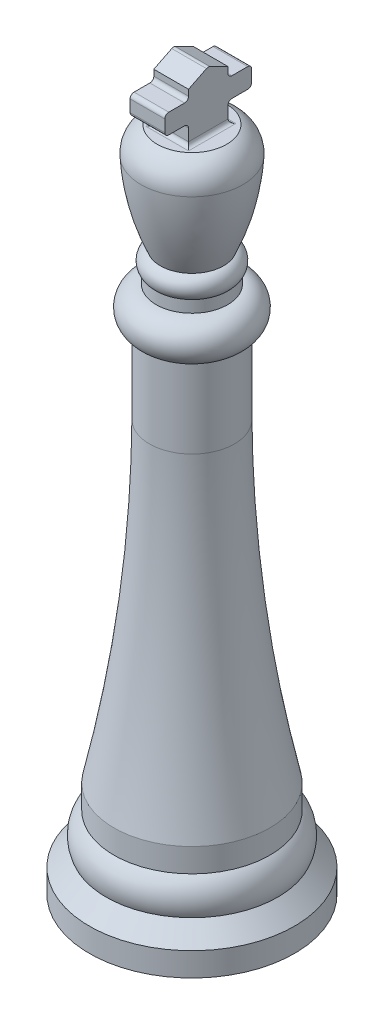
ISO-10303-21;
HEADER;
FILE_DESCRIPTION(('STEP AP214'),'2;1');
FILE_NAME('part.step','',(''),(''),'','','');
FILE_SCHEMA(('AUTOMOTIVE_DESIGN { 1 0 10303 214 1 1 1 1 }'));
ENDSEC;
DATA;
#1=APPLICATION_CONTEXT('core data for automotive mechanical design processes');
#2=APPLICATION_PROTOCOL_DEFINITION('international standard','automotive_design',2000,#1);
#3=PRODUCT_CONTEXT('',#1,'mechanical');
#4=PRODUCT('Part','Part','',(#3));
#5=PRODUCT_RELATED_PRODUCT_CATEGORY('part','',(#4));
#6=PRODUCT_DEFINITION_FORMATION('','',#4);
#7=PRODUCT_DEFINITION_CONTEXT('part definition',#1,'design');
#8=PRODUCT_DEFINITION('design','',#6,#7);
#9=PRODUCT_DEFINITION_SHAPE('','',#8);
#10=(LENGTH_UNIT() NAMED_UNIT(*) SI_UNIT(.MILLI.,.METRE.));
#11=(NAMED_UNIT(*) PLANE_ANGLE_UNIT() SI_UNIT($,.RADIAN.));
#12=(NAMED_UNIT(*) SI_UNIT($,.STERADIAN.) SOLID_ANGLE_UNIT());
#13=UNCERTAINTY_MEASURE_WITH_UNIT(LENGTH_MEASURE(1.E-05),#10,'distance_accuracy_value','');
#14=(GEOMETRIC_REPRESENTATION_CONTEXT(3) GLOBAL_UNCERTAINTY_ASSIGNED_CONTEXT((#13)) GLOBAL_UNIT_ASSIGNED_CONTEXT((#10,
#11,#12)) REPRESENTATION_CONTEXT('',''));
#15=CARTESIAN_POINT('',(0.,0.,0.));
#16=DIRECTION('',(0.,0.,1.));
#17=DIRECTION('',(1.,0.,0.));
#18=AXIS2_PLACEMENT_3D('',#15,#16,#17);
#19=CARTESIAN_POINT('',(2.23427851588815,42.926,0.));
#20=DIRECTION('',(0.,1.,0.));
#21=DIRECTION('',(0.,0.,1.));
#22=AXIS2_PLACEMENT_3D('',#19,#20,#21);
#23=PLANE('',#22);
#24=DIRECTION('',(0.,0.,1.));
#25=VECTOR('',#24,1.);
#26=CARTESIAN_POINT('',(-1.37113925794407,42.926,0.));
#27=LINE('',#26,#25);
#28=CARTESIAN_POINT('',(-1.37113925794406,42.926,1.5921332895163));
#29=VERTEX_POINT('',#28);
#30=CARTESIAN_POINT('',(-1.37113925794408,42.926,-1.4558667104837));
#31=VERTEX_POINT('',#30);
#32=EDGE_CURVE('E489',#29,#31,#27,.F.);
#33=ORIENTED_EDGE('',*,*,#32,.T.);
#34=DIRECTION('',(1.,0.,0.));
#35=VECTOR('',#34,1.);
#36=CARTESIAN_POINT('',(1.11713925794407,42.926,-1.45586671048372));
#37=LINE('',#36,#35);
#38=CARTESIAN_POINT('',(1.37113925794407,42.926,-1.45586671048372));
#39=VERTEX_POINT('',#38);
#40=EDGE_CURVE('E493',#31,#39,#37,.T.);
#41=ORIENTED_EDGE('',*,*,#40,.T.);
#42=DIRECTION('',(0.,0.,1.));
#43=VECTOR('',#42,1.);
#44=CARTESIAN_POINT('',(1.37113925794409,42.926,1.33813328951628));
#45=LINE('',#44,#43);
#46=CARTESIAN_POINT('',(1.3711392579441,42.926,1.59213328951628));
#47=VERTEX_POINT('',#46);
#48=EDGE_CURVE('E491',#39,#47,#45,.T.);
#49=ORIENTED_EDGE('',*,*,#48,.T.);
#50=DIRECTION('',(1.,0.,0.));
#51=VECTOR('',#50,1.);
#52=CARTESIAN_POINT('',(2.23427851588816,42.926,1.59213328951628));
#53=LINE('',#52,#51);
#54=EDGE_CURVE('E487',#47,#29,#53,.F.);
#55=ORIENTED_EDGE('',*,*,#54,.T.);
#56=EDGE_LOOP('',(#33,#41,#49,#55));
#57=FACE_BOUND('',#56,.T.);
#58=CARTESIAN_POINT('',(0.,42.926,0.));
#59=DIRECTION('',(0.,-1.,0.));
#60=DIRECTION('',(0.,0.,-1.));
#61=AXIS2_PLACEMENT_3D('',#58,#59,#60);
#62=CIRCLE('',#61,2.23427851588815);
#63=CARTESIAN_POINT('',(0.,42.926,-2.23427851588815));
#64=VERTEX_POINT('',#63);
#65=EDGE_CURVE('E281',#64,#64,#62,.T.);
#66=ORIENTED_EDGE('',*,*,#65,.F.);
#67=EDGE_LOOP('',(#66));
#68=FACE_BOUND('',#67,.T.);
#69=ADVANCED_FACE('F41',(#57,#68),#23,.T.);
#70=CARTESIAN_POINT('',(0.,0.,0.));
#71=DIRECTION('',(0.,-1.,0.));
#72=DIRECTION('',(0.,0.,-1.));
#73=AXIS2_PLACEMENT_3D('',#70,#71,#72);
#74=PLANE('',#73);
#75=CARTESIAN_POINT('',(0.,0.,0.));
#76=DIRECTION('',(0.,-1.,0.));
#77=DIRECTION('',(0.,0.,-1.));
#78=AXIS2_PLACEMENT_3D('',#75,#76,#77);
#79=CIRCLE('',#78,6.604);
#80=CARTESIAN_POINT('',(0.,0.,-6.604));
#81=VERTEX_POINT('',#80);
#82=EDGE_CURVE('E433',#81,#81,#79,.T.);
#83=ORIENTED_EDGE('',*,*,#82,.T.);
#84=EDGE_LOOP('',(#83));
#85=FACE_BOUND('',#84,.T.);
#86=ADVANCED_FACE('F353',(#85),#74,.T.);
#87=CARTESIAN_POINT('',(0.,0.,0.));
#88=DIRECTION('',(0.,-1.,0.));
#89=DIRECTION('',(0.,0.,-1.));
#90=AXIS2_PLACEMENT_3D('',#87,#88,#89);
#91=CYLINDRICAL_SURFACE('',#90,6.604);
#92=CARTESIAN_POINT('',(0.,1.524,0.));
#93=DIRECTION('',(0.,-1.,0.));
#94=DIRECTION('',(0.,0.,-1.));
#95=AXIS2_PLACEMENT_3D('',#92,#93,#94);
#96=CIRCLE('',#95,6.604);
#97=CARTESIAN_POINT('',(0.,1.524,-6.604));
#98=VERTEX_POINT('',#97);
#99=EDGE_CURVE('E430',#98,#98,#96,.T.);
#100=ORIENTED_EDGE('',*,*,#99,.T.);
#101=EDGE_LOOP('',(#100));
#102=FACE_BOUND('',#101,.T.);
#103=ORIENTED_EDGE('',*,*,#82,.F.);
#104=EDGE_LOOP('',(#103));
#105=FACE_BOUND('',#104,.T.);
#106=ADVANCED_FACE('F349',(#102,#105),#91,.T.);
#107=CARTESIAN_POINT('',(0.,1.524,0.));
#108=DIRECTION('',(0.,-1.,0.));
#109=DIRECTION('',(0.,0.,-1.));
#110=AXIS2_PLACEMENT_3D('',#107,#108,#109);
#111=CONICAL_SURFACE('',#110,6.604,0.785398163397448);
#112=CARTESIAN_POINT('',(0.,2.6016307345283,0.));
#113=DIRECTION('',(0.,-1.,0.));
#114=DIRECTION('',(0.,0.,-1.));
#115=AXIS2_PLACEMENT_3D('',#112,#113,#114);
#116=CIRCLE('',#115,5.5263692654717);
#117=CARTESIAN_POINT('',(0.,2.6016307345283,-5.5263692654717));
#118=VERTEX_POINT('',#117);
#119=EDGE_CURVE('E427',#118,#118,#116,.T.);
#120=ORIENTED_EDGE('',*,*,#119,.T.);
#121=EDGE_LOOP('',(#120));
#122=FACE_BOUND('',#121,.T.);
#123=ORIENTED_EDGE('',*,*,#99,.F.);
#124=EDGE_LOOP('',(#123));
#125=FACE_BOUND('',#124,.T.);
#126=ADVANCED_FACE('F345',(#122,#125),#111,.T.);
#127=CARTESIAN_POINT('',(0.,3.31038074482416,0.));
#128=DIRECTION('',(0.,-1.,0.));
#129=DIRECTION('',(0.,0.,-1.));
#130=AXIS2_PLACEMENT_3D('',#127,#128,#129);
#131=TOROIDAL_SURFACE('',#130,3.89573827628205,1.778);
#132=CARTESIAN_POINT('',(0.,4.68739876216002,0.));
#133=DIRECTION('',(0.,-1.,0.));
#134=DIRECTION('',(0.,0.,-1.));
#135=AXIS2_PLACEMENT_3D('',#132,#133,#134);
#136=CIRCLE('',#135,5.02050731032078);
#137=CARTESIAN_POINT('',(0.,4.68739876216002,-5.02050731032078));
#138=VERTEX_POINT('',#137);
#139=EDGE_CURVE('E424',#138,#138,#136,.T.);
#140=ORIENTED_EDGE('',*,*,#139,.T.);
#141=EDGE_LOOP('',(#140));
#142=FACE_BOUND('',#141,.T.);
#143=ORIENTED_EDGE('',*,*,#119,.F.);
#144=EDGE_LOOP('',(#143));
#145=FACE_BOUND('',#144,.T.);
#146=ADVANCED_FACE('F341',(#142,#145),#131,.T.);
#147=CARTESIAN_POINT('',(0.,0.,0.));
#148=DIRECTION('',(0.,-1.,0.));
#149=DIRECTION('',(0.,0.,-1.));
#150=AXIS2_PLACEMENT_3D('',#147,#148,#149);
#151=CYLINDRICAL_SURFACE('',#150,5.02050731032078);
#152=CARTESIAN_POINT('',(0.,6.21139876216002,0.));
#153=DIRECTION('',(0.,-1.,0.));
#154=DIRECTION('',(0.,0.,-1.));
#155=AXIS2_PLACEMENT_3D('',#152,#153,#154);
#156=CIRCLE('',#155,5.02050731032079);
#157=CARTESIAN_POINT('',(0.,6.21139876216002,-5.02050731032079));
#158=VERTEX_POINT('',#157);
#159=EDGE_CURVE('E416',#158,#158,#156,.T.);
#160=ORIENTED_EDGE('',*,*,#159,.T.);
#161=EDGE_LOOP('',(#160));
#162=FACE_BOUND('',#161,.T.);
#163=ORIENTED_EDGE('',*,*,#139,.F.);
#164=EDGE_LOOP('',(#163));
#165=FACE_BOUND('',#164,.T.);
#166=ADVANCED_FACE('F336',(#162,#165),#151,.T.);
#167=CARTESIAN_POINT('',(5.02050731032079,6.21139876216002,0.));
#168=CARTESIAN_POINT('',(2.79663497583493,16.1919932818318,0.));
#169=CARTESIAN_POINT('',(2.73354395721805,26.4720122158508,0.));
#170=B_SPLINE_CURVE_WITH_KNOTS('',2,(#167,#168,#169),.UNSPECIFIED.,.F.,.F.,(3,3),(0.,1.),.UNSPECIFIED.);
#171=CARTESIAN_POINT('',(0.,0.,0.));
#172=DIRECTION('',(0.,-1.,0.));
#173=AXIS1_PLACEMENT('',#171,#172);
#174=SURFACE_OF_REVOLUTION('',#170,#173);
#175=CARTESIAN_POINT('',(0.,26.4720122158508,0.));
#176=DIRECTION('',(0.,-1.,0.));
#177=DIRECTION('',(0.,0.,-1.));
#178=AXIS2_PLACEMENT_3D('',#175,#176,#177);
#179=CIRCLE('',#178,2.73354395721805);
#180=CARTESIAN_POINT('',(0.,26.4720122158508,-2.73354395721805));
#181=VERTEX_POINT('',#180);
#182=EDGE_CURVE('E413',#181,#181,#179,.T.);
#183=ORIENTED_EDGE('',*,*,#182,.T.);
#184=EDGE_LOOP('',(#183));
#185=FACE_BOUND('',#184,.T.);
#186=ORIENTED_EDGE('',*,*,#159,.F.);
#187=EDGE_LOOP('',(#186));
#188=FACE_BOUND('',#187,.T.);
#189=ADVANCED_FACE('F331',(#185,#188),#174,.F.);
#190=CARTESIAN_POINT('',(0.,0.,0.));
#191=DIRECTION('',(0.,-1.,0.));
#192=DIRECTION('',(0.,0.,-1.));
#193=AXIS2_PLACEMENT_3D('',#190,#191,#192);
#194=CYLINDRICAL_SURFACE('',#193,2.73354395721805);
#195=CARTESIAN_POINT('',(0.,31.5520122158508,0.));
#196=DIRECTION('',(0.,-1.,0.));
#197=DIRECTION('',(0.,0.,-1.));
#198=AXIS2_PLACEMENT_3D('',#195,#196,#197);
#199=CIRCLE('',#198,2.73354395721805);
#200=CARTESIAN_POINT('',(0.,31.5520122158508,-2.73354395721805));
#201=VERTEX_POINT('',#200);
#202=EDGE_CURVE('E412',#201,#201,#199,.T.);
#203=ORIENTED_EDGE('',*,*,#202,.T.);
#204=EDGE_LOOP('',(#203));
#205=FACE_BOUND('',#204,.T.);
#206=ORIENTED_EDGE('',*,*,#182,.F.);
#207=EDGE_LOOP('',(#206));
#208=FACE_BOUND('',#207,.T.);
#209=ADVANCED_FACE('F335',(#205,#208),#194,.T.);
#210=CARTESIAN_POINT('',(0.,32.7458638157194,0.));
#211=DIRECTION('',(0.,-1.,0.));
#212=DIRECTION('',(0.,0.,-1.));
#213=AXIS2_PLACEMENT_3D('',#210,#211,#212);
#214=TOROIDAL_SURFACE('',#213,2.3003946094276,1.27);
#215=CARTESIAN_POINT('',(0.,34.0158638157194,0.));
#216=DIRECTION('',(0.,-1.,0.));
#217=DIRECTION('',(0.,0.,-1.));
#218=AXIS2_PLACEMENT_3D('',#215,#216,#217);
#219=CIRCLE('',#218,2.3003946094276);
#220=CARTESIAN_POINT('',(0.,34.0158638157194,-2.3003946094276));
#221=VERTEX_POINT('',#220);
#222=EDGE_CURVE('E409',#221,#221,#219,.T.);
#223=ORIENTED_EDGE('',*,*,#222,.T.);
#224=EDGE_LOOP('',(#223));
#225=FACE_BOUND('',#224,.T.);
#226=ORIENTED_EDGE('',*,*,#202,.F.);
#227=EDGE_LOOP('',(#226));
#228=FACE_BOUND('',#227,.T.);
#229=ADVANCED_FACE('F398',(#225,#228),#214,.T.);
#230=CARTESIAN_POINT('',(0.,0.,0.));
#231=DIRECTION('',(0.,-1.,0.));
#232=DIRECTION('',(0.,0.,-1.));
#233=AXIS2_PLACEMENT_3D('',#230,#231,#232);
#234=CYLINDRICAL_SURFACE('',#233,2.3003946094276);
#235=CARTESIAN_POINT('',(0.,34.7778638157194,0.));
#236=DIRECTION('',(0.,-1.,0.));
#237=DIRECTION('',(0.,0.,-1.));
#238=AXIS2_PLACEMENT_3D('',#235,#236,#237);
#239=CIRCLE('',#238,2.3003946094276);
#240=CARTESIAN_POINT('',(0.,34.7778638157194,-2.3003946094276));
#241=VERTEX_POINT('',#240);
#242=EDGE_CURVE('E418',#241,#241,#239,.T.);
#243=ORIENTED_EDGE('',*,*,#242,.T.);
#244=EDGE_LOOP('',(#243));
#245=FACE_BOUND('',#244,.T.);
#246=ORIENTED_EDGE('',*,*,#222,.F.);
#247=EDGE_LOOP('',(#246));
#248=FACE_BOUND('',#247,.T.);
#249=ADVANCED_FACE('F395',(#245,#248),#234,.T.);
#250=CARTESIAN_POINT('',(0.,35.3364382945624,0.));
#251=DIRECTION('',(0.,-1.,0.));
#252=DIRECTION('',(0.,0.,-1.));
#253=AXIS2_PLACEMENT_3D('',#250,#251,#252);
#254=TOROIDAL_SURFACE('',#253,1.78209107713667,0.762);
#255=CARTESIAN_POINT('',(0.,36.0544116939489,0.));
#256=DIRECTION('',(0.,-1.,0.));
#257=DIRECTION('',(0.,0.,-1.));
#258=AXIS2_PLACEMENT_3D('',#255,#256,#257);
#259=CIRCLE('',#258,2.03735211563147);
#260=CARTESIAN_POINT('',(0.,36.0544116939489,-2.03735211563147));
#261=VERTEX_POINT('',#260);
#262=EDGE_CURVE('E909',#261,#261,#259,.T.);
#263=ORIENTED_EDGE('',*,*,#262,.T.);
#264=EDGE_LOOP('',(#263));
#265=FACE_BOUND('',#264,.T.);
#266=ORIENTED_EDGE('',*,*,#242,.F.);
#267=EDGE_LOOP('',(#266));
#268=FACE_BOUND('',#267,.T.);
#269=ADVANCED_FACE('F391',(#265,#268),#254,.T.);
#270=CARTESIAN_POINT('',(2.03735211563147,36.0544116939489,0.));
#271=CARTESIAN_POINT('',(2.75458880196994,37.6906108210151,0.));
#272=CARTESIAN_POINT('',(3.171523279303,39.4171242700639,0.));
#273=CARTESIAN_POINT('',(3.27973491167088,41.1965121927396,0.));
#274=B_SPLINE_CURVE_WITH_KNOTS('',3,(#270,#271,#272,#273),.UNSPECIFIED.,.F.,.F.,(4,4),(0.,
0.825528863209232),.UNSPECIFIED.);
#275=CARTESIAN_POINT('',(0.,0.,0.));
#276=DIRECTION('',(0.,-1.,0.));
#277=AXIS1_PLACEMENT('',#275,#276);
#278=SURFACE_OF_REVOLUTION('',#274,#277);
#279=CARTESIAN_POINT('',(0.,41.1965121927396,0.));
#280=DIRECTION('',(0.,-1.,0.));
#281=DIRECTION('',(0.,0.,-1.));
#282=AXIS2_PLACEMENT_3D('',#279,#280,#281);
#283=CIRCLE('',#282,3.27973491167088);
#284=CARTESIAN_POINT('',(0.,41.1965121927396,-3.27973491167088));
#285=VERTEX_POINT('',#284);
#286=EDGE_CURVE('E912',#285,#285,#283,.T.);
#287=ORIENTED_EDGE('',*,*,#286,.T.);
#288=EDGE_LOOP('',(#287));
#289=FACE_BOUND('',#288,.T.);
#290=ORIENTED_EDGE('',*,*,#262,.F.);
#291=EDGE_LOOP('',(#290));
#292=FACE_BOUND('',#291,.T.);
#293=ADVANCED_FACE('F387',(#289,#292),#278,.F.);
#294=CARTESIAN_POINT('',(0.,41.3044400273974,0.));
#295=DIRECTION('',(0.,-1.,0.));
#296=DIRECTION('',(0.,0.,-1.));
#297=AXIS2_PLACEMENT_3D('',#294,#295,#296);
#298=DEGENERATE_TOROIDAL_SURFACE('',#297,1.50501364270888,1.778,.T.);
#299=ORIENTED_EDGE('',*,*,#65,.T.);
#300=EDGE_LOOP('',(#299));
#301=FACE_BOUND('',#300,.T.);
#302=ORIENTED_EDGE('',*,*,#286,.F.);
#303=EDGE_LOOP('',(#302));
#304=FACE_BOUND('',#303,.T.);
#305=ADVANCED_FACE('F384',(#301,#304),#298,.T.);
#306=CARTESIAN_POINT('',(1.11713925794408,46.736,0.));
#307=DIRECTION('',(1.,0.,0.));
#308=DIRECTION('',(0.,0.,-1.));
#309=AXIS2_PLACEMENT_3D('',#306,#307,#308);
#310=PLANE('',#309);
#311=DIRECTION('',(0.,1.,0.));
#312=VECTOR('',#311,1.);
#313=CARTESIAN_POINT('',(1.11713925794409,0.,1.33813328951628));
#314=LINE('',#313,#312);
#315=CARTESIAN_POINT('',(1.11713925794409,43.18,1.33813328951628));
#316=VERTEX_POINT('',#315);
#317=CARTESIAN_POINT('',(1.11713925794409,43.942,1.33813328951628));
#318=VERTEX_POINT('',#317);
#319=EDGE_CURVE('E253',#316,#318,#314,.T.);
#320=ORIENTED_EDGE('',*,*,#319,.F.);
#321=DIRECTION('',(0.,0.,1.));
#322=VECTOR('',#321,1.);
#323=CARTESIAN_POINT('',(1.11713925794408,43.18,-1.20186671048372));
#324=LINE('',#323,#322);
#325=CARTESIAN_POINT('',(1.11713925794408,43.18,-1.20186671048372));
#326=VERTEX_POINT('',#325);
#327=EDGE_CURVE('E499',#316,#326,#324,.F.);
#328=ORIENTED_EDGE('',*,*,#327,.T.);
#329=DIRECTION('',(0.,1.,0.));
#330=VECTOR('',#329,1.);
#331=CARTESIAN_POINT('',(1.11713925794408,0.,-1.20186671048372));
#332=LINE('',#331,#330);
#333=CARTESIAN_POINT('',(1.11713925794408,43.942,-1.20186671048372));
#334=VERTEX_POINT('',#333);
#335=EDGE_CURVE('E251',#326,#334,#332,.T.);
#336=ORIENTED_EDGE('',*,*,#335,.T.);
#337=CARTESIAN_POINT('',(1.11713925794407,43.942,-1.45586671048372));
#338=DIRECTION('',(1.,0.,0.));
#339=DIRECTION('',(0.,0.,-1.));
#340=AXIS2_PLACEMENT_3D('',#337,#338,#339);
#341=CIRCLE('',#340,0.253999999999999);
#342=CARTESIAN_POINT('',(1.11713925794407,44.196,-1.45586671048372));
#343=VERTEX_POINT('',#342);
#344=EDGE_CURVE('E248',#334,#343,#341,.F.);
#345=ORIENTED_EDGE('',*,*,#344,.T.);
#346=DIRECTION('',(0.,0.,-1.));
#347=VECTOR('',#346,1.);
#348=CARTESIAN_POINT('',(1.11713925794408,44.196,0.));
#349=LINE('',#348,#347);
#350=CARTESIAN_POINT('',(1.11713925794407,44.196,-2.47186671048371));
#351=VERTEX_POINT('',#350);
#352=EDGE_CURVE('E245',#343,#351,#349,.T.);
#353=ORIENTED_EDGE('',*,*,#352,.T.);
#354=CARTESIAN_POINT('',(1.11713925794407,44.45,-2.47186671048372));
#355=DIRECTION('',(1.,0.,0.));
#356=DIRECTION('',(0.,0.,-1.));
#357=AXIS2_PLACEMENT_3D('',#354,#355,#356);
#358=CIRCLE('',#357,0.253999999999999);
#359=CARTESIAN_POINT('',(1.11713925794407,44.45,-2.72586671048372));
#360=VERTEX_POINT('',#359);
#361=EDGE_CURVE('E242',#351,#360,#358,.T.);
#362=ORIENTED_EDGE('',*,*,#361,.T.);
#363=DIRECTION('',(0.,1.,0.));
#364=VECTOR('',#363,1.);
#365=CARTESIAN_POINT('',(1.11713925794407,0.,-2.72586671048372));
#366=LINE('',#365,#364);
#367=CARTESIAN_POINT('',(1.11713925794407,45.212,-2.72586671048372));
#368=VERTEX_POINT('',#367);
#369=EDGE_CURVE('E239',#360,#368,#366,.T.);
#370=ORIENTED_EDGE('',*,*,#369,.T.);
#371=CARTESIAN_POINT('',(1.11713925794407,45.212,-2.47186671048372));
#372=DIRECTION('',(1.,0.,0.));
#373=DIRECTION('',(0.,0.,-1.));
#374=AXIS2_PLACEMENT_3D('',#371,#372,#373);
#375=CIRCLE('',#374,0.253999999999999);
#376=CARTESIAN_POINT('',(1.11713925794407,45.466,-2.47186671048371));
#377=VERTEX_POINT('',#376);
#378=EDGE_CURVE('E236',#368,#377,#375,.T.);
#379=ORIENTED_EDGE('',*,*,#378,.T.);
#380=DIRECTION('',(0.,0.,1.));
#381=VECTOR('',#380,1.);
#382=CARTESIAN_POINT('',(1.11713925794408,45.466,0.));
#383=LINE('',#382,#381);
#384=CARTESIAN_POINT('',(1.11713925794407,45.466,-1.45586671048372));
#385=VERTEX_POINT('',#384);
#386=EDGE_CURVE('E233',#377,#385,#383,.T.);
#387=ORIENTED_EDGE('',*,*,#386,.T.);
#388=CARTESIAN_POINT('',(1.11713925794407,45.72,-1.45586671048372));
#389=DIRECTION('',(1.,0.,0.));
#390=DIRECTION('',(0.,0.,-1.));
#391=AXIS2_PLACEMENT_3D('',#388,#389,#390);
#392=CIRCLE('',#391,0.253999999999999);
#393=CARTESIAN_POINT('',(1.11713925794408,45.72,-1.20186671048372));
#394=VERTEX_POINT('',#393);
#395=EDGE_CURVE('E229',#385,#394,#392,.F.);
#396=ORIENTED_EDGE('',*,*,#395,.T.);
#397=DIRECTION('',(0.,1.,0.));
#398=VECTOR('',#397,1.);
#399=CARTESIAN_POINT('',(1.11713925794408,0.,-1.20186671048372));
#400=LINE('',#399,#398);
#401=CARTESIAN_POINT('',(1.11713925794408,46.1061898301753,-1.20186671048372));
#402=VERTEX_POINT('',#401);
#403=EDGE_CURVE('E227',#394,#402,#400,.T.);
#404=ORIENTED_EDGE('',*,*,#403,.T.);
#405=DIRECTION('',(0.,0.444282378740379,0.895886805316827));
#406=VECTOR('',#405,1.);
#407=CARTESIAN_POINT('',(1.11713925794396,37.4838101470672,-18.5887282160634));
#408=LINE('',#407,#406);
#409=CARTESIAN_POINT('',(1.11713925794408,46.6800372879191,-0.0447144346837729));
#410=VERTEX_POINT('',#409);
#411=EDGE_CURVE('E206',#402,#410,#408,.T.);
#412=ORIENTED_EDGE('',*,*,#411,.T.);
#413=CARTESIAN_POINT('',(1.11713925794408,46.4524820393686,0.0681332895162846));
#414=DIRECTION('',(1.,0.,0.));
#415=DIRECTION('',(0.,0.,-1.));
#416=AXIS2_PLACEMENT_3D('',#413,#414,#415);
#417=CIRCLE('',#416,0.254000000000002);
#418=CARTESIAN_POINT('',(1.11713925794409,46.6800372879191,0.180981013716344));
#419=VERTEX_POINT('',#418);
#420=EDGE_CURVE('E216',#410,#419,#417,.T.);
#421=ORIENTED_EDGE('',*,*,#420,.T.);
#422=DIRECTION('',(0.,0.444282378740379,-0.895886805316827));
#423=VECTOR('',#422,1.);
#424=CARTESIAN_POINT('',(1.11713925794421,37.5380478866944,18.6156254444141));
#425=LINE('',#424,#423);
#426=CARTESIAN_POINT('',(1.11713925794409,46.1061898301753,1.33813328951628));
#427=VERTEX_POINT('',#426);
#428=EDGE_CURVE('E213',#427,#419,#425,.T.);
#429=ORIENTED_EDGE('',*,*,#428,.F.);
#430=DIRECTION('',(0.,1.,0.));
#431=VECTOR('',#430,1.);
#432=CARTESIAN_POINT('',(1.11713925794409,0.,1.33813328951628));
#433=LINE('',#432,#431);
#434=CARTESIAN_POINT('',(1.11713925794409,45.72,1.33813328951628));
#435=VERTEX_POINT('',#434);
#436=EDGE_CURVE('E276',#435,#427,#433,.T.);
#437=ORIENTED_EDGE('',*,*,#436,.F.);
#438=CARTESIAN_POINT('',(1.1171392579441,45.72,1.59213328951628));
#439=DIRECTION('',(1.,0.,0.));
#440=DIRECTION('',(0.,0.,-1.));
#441=AXIS2_PLACEMENT_3D('',#438,#439,#440);
#442=CIRCLE('',#441,0.253999999999999);
#443=CARTESIAN_POINT('',(1.1171392579441,45.466,1.59213328951629));
#444=VERTEX_POINT('',#443);
#445=EDGE_CURVE('E273',#444,#435,#442,.T.);
#446=ORIENTED_EDGE('',*,*,#445,.F.);
#447=DIRECTION('',(0.,0.,-1.));
#448=VECTOR('',#447,1.);
#449=CARTESIAN_POINT('',(1.11713925794408,45.466,0.));
#450=LINE('',#449,#448);
#451=CARTESIAN_POINT('',(1.1171392579441,45.466,2.60813328951628));
#452=VERTEX_POINT('',#451);
#453=EDGE_CURVE('E270',#452,#444,#450,.T.);
#454=ORIENTED_EDGE('',*,*,#453,.F.);
#455=CARTESIAN_POINT('',(1.1171392579441,45.212,2.60813328951629));
#456=DIRECTION('',(1.,0.,0.));
#457=DIRECTION('',(0.,0.,-1.));
#458=AXIS2_PLACEMENT_3D('',#455,#456,#457);
#459=CIRCLE('',#458,0.253999999999999);
#460=CARTESIAN_POINT('',(1.1171392579441,45.212,2.86213328951629));
#461=VERTEX_POINT('',#460);
#462=EDGE_CURVE('E267',#461,#452,#459,.F.);
#463=ORIENTED_EDGE('',*,*,#462,.F.);
#464=DIRECTION('',(0.,1.,0.));
#465=VECTOR('',#464,1.);
#466=CARTESIAN_POINT('',(1.1171392579441,0.,2.86213328951629));
#467=LINE('',#466,#465);
#468=CARTESIAN_POINT('',(1.1171392579441,44.45,2.86213328951629));
#469=VERTEX_POINT('',#468);
#470=EDGE_CURVE('E264',#469,#461,#467,.T.);
#471=ORIENTED_EDGE('',*,*,#470,.F.);
#472=CARTESIAN_POINT('',(1.1171392579441,44.45,2.60813328951629));
#473=DIRECTION('',(1.,0.,0.));
#474=DIRECTION('',(0.,0.,-1.));
#475=AXIS2_PLACEMENT_3D('',#472,#473,#474);
#476=CIRCLE('',#475,0.253999999999999);
#477=CARTESIAN_POINT('',(1.1171392579441,44.196,2.60813328951628));
#478=VERTEX_POINT('',#477);
#479=EDGE_CURVE('E261',#478,#469,#476,.F.);
#480=ORIENTED_EDGE('',*,*,#479,.F.);
#481=DIRECTION('',(0.,0.,1.));
#482=VECTOR('',#481,1.);
#483=CARTESIAN_POINT('',(1.11713925794408,44.196,0.));
#484=LINE('',#483,#482);
#485=CARTESIAN_POINT('',(1.1171392579441,44.196,1.59213328951629));
#486=VERTEX_POINT('',#485);
#487=EDGE_CURVE('E258',#486,#478,#484,.T.);
#488=ORIENTED_EDGE('',*,*,#487,.F.);
#489=CARTESIAN_POINT('',(1.1171392579441,43.942,1.59213328951628));
#490=DIRECTION('',(1.,0.,0.));
#491=DIRECTION('',(0.,0.,-1.));
#492=AXIS2_PLACEMENT_3D('',#489,#490,#491);
#493=CIRCLE('',#492,0.253999999999999);
#494=EDGE_CURVE('E255',#318,#486,#493,.T.);
#495=ORIENTED_EDGE('',*,*,#494,.F.);
#496=EDGE_LOOP('',(#320,#328,#336,#345,#353,#362,#370,#379,#387,#396,#404,#412,#421,#429,#437,
#446,#454,#463,#471,#480,#488,#495));
#497=FACE_BOUND('',#496,.T.);
#498=ADVANCED_FACE('F224',(#497),#310,.T.);
#499=CARTESIAN_POINT('',(-1.11713925794407,46.736,0.));
#500=DIRECTION('',(1.,0.,0.));
#501=DIRECTION('',(0.,0.,-1.));
#502=AXIS2_PLACEMENT_3D('',#499,#500,#501);
#503=PLANE('',#502);
#504=DIRECTION('',(0.,1.,0.));
#505=VECTOR('',#504,1.);
#506=CARTESIAN_POINT('',(-1.11713925794408,46.736,-1.2018667104837));
#507=LINE('',#506,#505);
#508=CARTESIAN_POINT('',(-1.11713925794408,43.18,-1.2018667104837));
#509=VERTEX_POINT('',#508);
#510=CARTESIAN_POINT('',(-1.11713925794408,43.942,-1.2018667104837));
#511=VERTEX_POINT('',#510);
#512=EDGE_CURVE('E454',#509,#511,#507,.T.);
#513=ORIENTED_EDGE('',*,*,#512,.F.);
#514=DIRECTION('',(0.,0.,1.));
#515=VECTOR('',#514,1.);
#516=CARTESIAN_POINT('',(-1.11713925794407,43.18,0.));
#517=LINE('',#516,#515);
#518=CARTESIAN_POINT('',(-1.11713925794406,43.18,1.3381332895163));
#519=VERTEX_POINT('',#518);
#520=EDGE_CURVE('E50',#509,#519,#517,.T.);
#521=ORIENTED_EDGE('',*,*,#520,.T.);
#522=DIRECTION('',(0.,1.,0.));
#523=VECTOR('',#522,1.);
#524=CARTESIAN_POINT('',(-1.11713925794406,46.736,1.3381332895163));
#525=LINE('',#524,#523);
#526=CARTESIAN_POINT('',(-1.11713925794406,43.942,1.3381332895163));
#527=VERTEX_POINT('',#526);
#528=EDGE_CURVE('E485',#519,#527,#525,.T.);
#529=ORIENTED_EDGE('',*,*,#528,.T.);
#530=CARTESIAN_POINT('',(-1.11713925794406,43.942,1.5921332895163));
#531=DIRECTION('',(1.,0.,0.));
#532=DIRECTION('',(0.,0.,-1.));
#533=AXIS2_PLACEMENT_3D('',#530,#531,#532);
#534=CIRCLE('',#533,0.253999999999999);
#535=CARTESIAN_POINT('',(-1.11713925794406,44.196,1.5921332895163));
#536=VERTEX_POINT('',#535);
#537=EDGE_CURVE('E482',#527,#536,#534,.T.);
#538=ORIENTED_EDGE('',*,*,#537,.T.);
#539=DIRECTION('',(0.,0.,1.));
#540=VECTOR('',#539,1.);
#541=CARTESIAN_POINT('',(-1.11713925794407,44.196,0.));
#542=LINE('',#541,#540);
#543=CARTESIAN_POINT('',(-1.11713925794406,44.196,2.6081332895163));
#544=VERTEX_POINT('',#543);
#545=EDGE_CURVE('E479',#536,#544,#542,.T.);
#546=ORIENTED_EDGE('',*,*,#545,.T.);
#547=CARTESIAN_POINT('',(-1.11713925794405,44.45,2.6081332895163));
#548=DIRECTION('',(1.,0.,0.));
#549=DIRECTION('',(0.,0.,-1.));
#550=AXIS2_PLACEMENT_3D('',#547,#548,#549);
#551=CIRCLE('',#550,0.253999999999999);
#552=CARTESIAN_POINT('',(-1.11713925794405,44.45,2.8621332895163));
#553=VERTEX_POINT('',#552);
#554=EDGE_CURVE('E476',#544,#553,#551,.F.);
#555=ORIENTED_EDGE('',*,*,#554,.T.);
#556=DIRECTION('',(0.,1.,0.));
#557=VECTOR('',#556,1.);
#558=CARTESIAN_POINT('',(-1.11713925794405,46.736,2.8621332895163));
#559=LINE('',#558,#557);
#560=CARTESIAN_POINT('',(-1.11713925794405,45.212,2.8621332895163));
#561=VERTEX_POINT('',#560);
#562=EDGE_CURVE('E473',#553,#561,#559,.T.);
#563=ORIENTED_EDGE('',*,*,#562,.T.);
#564=CARTESIAN_POINT('',(-1.11713925794405,45.212,2.6081332895163));
#565=DIRECTION('',(1.,0.,0.));
#566=DIRECTION('',(0.,0.,-1.));
#567=AXIS2_PLACEMENT_3D('',#564,#565,#566);
#568=CIRCLE('',#567,0.253999999999999);
#569=CARTESIAN_POINT('',(-1.11713925794405,45.466,2.6081332895163));
#570=VERTEX_POINT('',#569);
#571=EDGE_CURVE('E470',#561,#570,#568,.F.);
#572=ORIENTED_EDGE('',*,*,#571,.T.);
#573=DIRECTION('',(0.,0.,-1.));
#574=VECTOR('',#573,1.);
#575=CARTESIAN_POINT('',(-1.11713925794407,45.466,0.));
#576=LINE('',#575,#574);
#577=CARTESIAN_POINT('',(-1.11713925794406,45.466,1.5921332895163));
#578=VERTEX_POINT('',#577);
#579=EDGE_CURVE('E467',#570,#578,#576,.T.);
#580=ORIENTED_EDGE('',*,*,#579,.T.);
#581=CARTESIAN_POINT('',(-1.11713925794406,45.72,1.5921332895163));
#582=DIRECTION('',(1.,0.,0.));
#583=DIRECTION('',(0.,0.,-1.));
#584=AXIS2_PLACEMENT_3D('',#581,#582,#583);
#585=CIRCLE('',#584,0.253999999999999);
#586=CARTESIAN_POINT('',(-1.11713925794406,45.72,1.3381332895163));
#587=VERTEX_POINT('',#586);
#588=EDGE_CURVE('E464',#578,#587,#585,.T.);
#589=ORIENTED_EDGE('',*,*,#588,.T.);
#590=DIRECTION('',(0.,1.,0.));
#591=VECTOR('',#590,1.);
#592=CARTESIAN_POINT('',(-1.11713925794406,46.736,1.3381332895163));
#593=LINE('',#592,#591);
#594=CARTESIAN_POINT('',(-1.11713925794406,46.1061898301753,1.3381332895163));
#595=VERTEX_POINT('',#594);
#596=EDGE_CURVE('E461',#587,#595,#593,.T.);
#597=ORIENTED_EDGE('',*,*,#596,.T.);
#598=DIRECTION('',(0.,0.444282378740379,-0.895886805316827));
#599=VECTOR('',#598,1.);
#600=CARTESIAN_POINT('',(-1.11713925794407,46.7631188698136,0.0134486141754039));
#601=LINE('',#600,#599);
#602=CARTESIAN_POINT('',(-1.11713925794407,46.6800372879191,0.18098101371636));
#603=VERTEX_POINT('',#602);
#604=EDGE_CURVE('E458',#595,#603,#601,.T.);
#605=ORIENTED_EDGE('',*,*,#604,.T.);
#606=CARTESIAN_POINT('',(-1.11713925794407,46.4524820393686,0.0681332895163002));
#607=DIRECTION('',(1.,0.,0.));
#608=DIRECTION('',(0.,0.,-1.));
#609=AXIS2_PLACEMENT_3D('',#606,#607,#608);
#610=CIRCLE('',#609,0.254000000000002);
#611=CARTESIAN_POINT('',(-1.11713925794408,46.6800372879191,-0.0447144346837573));
#612=VERTEX_POINT('',#611);
#613=EDGE_CURVE('E456',#612,#603,#610,.T.);
#614=ORIENTED_EDGE('',*,*,#613,.F.);
#615=DIRECTION('',(0.,0.444282378740379,0.895886805316827));
#616=VECTOR('',#615,1.);
#617=CARTESIAN_POINT('',(-1.11713925794407,46.7088811301864,0.0134486141753985));
#618=LINE('',#617,#616);
#619=CARTESIAN_POINT('',(-1.11713925794408,46.1061898301753,-1.20186671048372));
#620=VERTEX_POINT('',#619);
#621=EDGE_CURVE('E209',#620,#612,#618,.T.);
#622=ORIENTED_EDGE('',*,*,#621,.F.);
#623=DIRECTION('',(0.,1.,0.));
#624=VECTOR('',#623,1.);
#625=CARTESIAN_POINT('',(-1.11713925794408,46.736,-1.2018667104837));
#626=LINE('',#625,#624);
#627=CARTESIAN_POINT('',(-1.11713925794408,45.72,-1.2018667104837));
#628=VERTEX_POINT('',#627);
#629=EDGE_CURVE('E437',#628,#620,#626,.T.);
#630=ORIENTED_EDGE('',*,*,#629,.F.);
#631=CARTESIAN_POINT('',(-1.11713925794408,45.72,-1.4558667104837));
#632=DIRECTION('',(1.,0.,0.));
#633=DIRECTION('',(0.,0.,-1.));
#634=AXIS2_PLACEMENT_3D('',#631,#632,#633);
#635=CIRCLE('',#634,0.253999999999999);
#636=CARTESIAN_POINT('',(-1.11713925794408,45.466,-1.4558667104837));
#637=VERTEX_POINT('',#636);
#638=EDGE_CURVE('E440',#637,#628,#635,.F.);
#639=ORIENTED_EDGE('',*,*,#638,.F.);
#640=DIRECTION('',(0.,0.,1.));
#641=VECTOR('',#640,1.);
#642=CARTESIAN_POINT('',(-1.11713925794407,45.466,0.));
#643=LINE('',#642,#641);
#644=CARTESIAN_POINT('',(-1.11713925794408,45.466,-2.4718667104837));
#645=VERTEX_POINT('',#644);
#646=EDGE_CURVE('E442',#645,#637,#643,.T.);
#647=ORIENTED_EDGE('',*,*,#646,.F.);
#648=CARTESIAN_POINT('',(-1.11713925794409,45.212,-2.4718667104837));
#649=DIRECTION('',(1.,0.,0.));
#650=DIRECTION('',(0.,0.,-1.));
#651=AXIS2_PLACEMENT_3D('',#648,#649,#650);
#652=CIRCLE('',#651,0.253999999999999);
#653=CARTESIAN_POINT('',(-1.11713925794409,45.212,-2.7258667104837));
#654=VERTEX_POINT('',#653);
#655=EDGE_CURVE('E444',#654,#645,#652,.T.);
#656=ORIENTED_EDGE('',*,*,#655,.F.);
#657=DIRECTION('',(0.,1.,0.));
#658=VECTOR('',#657,1.);
#659=CARTESIAN_POINT('',(-1.11713925794409,46.736,-2.7258667104837));
#660=LINE('',#659,#658);
#661=CARTESIAN_POINT('',(-1.11713925794409,44.45,-2.7258667104837));
#662=VERTEX_POINT('',#661);
#663=EDGE_CURVE('E446',#662,#654,#660,.T.);
#664=ORIENTED_EDGE('',*,*,#663,.F.);
#665=CARTESIAN_POINT('',(-1.11713925794409,44.45,-2.4718667104837));
#666=DIRECTION('',(1.,0.,0.));
#667=DIRECTION('',(0.,0.,-1.));
#668=AXIS2_PLACEMENT_3D('',#665,#666,#667);
#669=CIRCLE('',#668,0.253999999999999);
#670=CARTESIAN_POINT('',(-1.11713925794409,44.196,-2.4718667104837));
#671=VERTEX_POINT('',#670);
#672=EDGE_CURVE('E448',#671,#662,#669,.T.);
#673=ORIENTED_EDGE('',*,*,#672,.F.);
#674=DIRECTION('',(0.,0.,-1.));
#675=VECTOR('',#674,1.);
#676=CARTESIAN_POINT('',(-1.11713925794407,44.196,0.));
#677=LINE('',#676,#675);
#678=CARTESIAN_POINT('',(-1.11713925794408,44.196,-1.4558667104837));
#679=VERTEX_POINT('',#678);
#680=EDGE_CURVE('E450',#679,#671,#677,.T.);
#681=ORIENTED_EDGE('',*,*,#680,.F.);
#682=CARTESIAN_POINT('',(-1.11713925794408,43.942,-1.4558667104837));
#683=DIRECTION('',(1.,0.,0.));
#684=DIRECTION('',(0.,0.,-1.));
#685=AXIS2_PLACEMENT_3D('',#682,#683,#684);
#686=CIRCLE('',#685,0.253999999999999);
#687=EDGE_CURVE('E452',#511,#679,#686,.F.);
#688=ORIENTED_EDGE('',*,*,#687,.F.);
#689=EDGE_LOOP('',(#513,#521,#529,#538,#546,#555,#563,#572,#580,#589,#597,#605,#614,#622,#630,
#639,#647,#656,#664,#673,#681,#688));
#690=FACE_BOUND('',#689,.T.);
#691=ADVANCED_FACE('F560',(#690),#503,.F.);
#692=CARTESIAN_POINT('',(-1.16886074205592,46.4524820393686,0.0681332895163005));
#693=DIRECTION('',(1.,0.,0.));
#694=DIRECTION('',(0.,0.,-1.));
#695=AXIS2_PLACEMENT_3D('',#692,#693,#694);
#696=CYLINDRICAL_SURFACE('',#695,0.254000000000002);
#697=ORIENTED_EDGE('',*,*,#613,.T.);
#698=DIRECTION('',(1.,0.,0.));
#699=VECTOR('',#698,1.);
#700=CARTESIAN_POINT('',(-1.16886074205591,46.6800372879191,0.18098101371636));
#701=LINE('',#700,#699);
#702=EDGE_CURVE('E219',#603,#419,#701,.T.);
#703=ORIENTED_EDGE('',*,*,#702,.T.);
#704=ORIENTED_EDGE('',*,*,#420,.F.);
#705=DIRECTION('',(1.,0.,0.));
#706=VECTOR('',#705,1.);
#707=CARTESIAN_POINT('',(-1.16886074205592,46.6800372879191,-0.044714434683757));
#708=LINE('',#707,#706);
#709=EDGE_CURVE('E202',#612,#410,#708,.T.);
#710=ORIENTED_EDGE('',*,*,#709,.F.);
#711=EDGE_LOOP('',(#697,#703,#704,#710));
#712=FACE_BOUND('',#711,.T.);
#713=ADVANCED_FACE('F217',(#712),#696,.T.);
#714=CARTESIAN_POINT('',(-1.16886074205579,37.5380478866944,18.6156254444142));
#715=DIRECTION('',(0.,-0.895886805316827,-0.444282378740379));
#716=DIRECTION('',(0.,0.444282378740379,-0.895886805316827));
#717=AXIS2_PLACEMENT_3D('',#714,#715,#716);
#718=PLANE('',#717);
#719=DIRECTION('',(1.,0.,0.));
#720=VECTOR('',#719,1.);
#721=CARTESIAN_POINT('',(-1.16886074205591,46.1061898301753,1.3381332895163));
#722=LINE('',#721,#720);
#723=EDGE_CURVE('E282',#595,#427,#722,.T.);
#724=ORIENTED_EDGE('',*,*,#723,.T.);
#725=ORIENTED_EDGE('',*,*,#428,.T.);
#726=ORIENTED_EDGE('',*,*,#702,.F.);
#727=ORIENTED_EDGE('',*,*,#604,.F.);
#728=EDGE_LOOP('',(#724,#725,#726,#727));
#729=FACE_BOUND('',#728,.T.);
#730=ADVANCED_FACE('F562',(#729),#718,.F.);
#731=CARTESIAN_POINT('',(-1.16886074205591,0.,1.3381332895163));
#732=DIRECTION('',(0.,0.,-1.));
#733=DIRECTION('',(-1.,0.,0.));
#734=AXIS2_PLACEMENT_3D('',#731,#732,#733);
#735=PLANE('',#734);
#736=DIRECTION('',(1.,0.,0.));
#737=VECTOR('',#736,1.);
#738=CARTESIAN_POINT('',(-1.16886074205591,45.72,1.3381332895163));
#739=LINE('',#738,#737);
#740=EDGE_CURVE('E284',#587,#435,#739,.T.);
#741=ORIENTED_EDGE('',*,*,#740,.T.);
#742=ORIENTED_EDGE('',*,*,#436,.T.);
#743=ORIENTED_EDGE('',*,*,#723,.F.);
#744=ORIENTED_EDGE('',*,*,#596,.F.);
#745=EDGE_LOOP('',(#741,#742,#743,#744));
#746=FACE_BOUND('',#745,.T.);
#747=ADVANCED_FACE('F568',(#746),#735,.F.);
#748=CARTESIAN_POINT('',(-1.1688607420559,45.72,1.5921332895163));
#749=DIRECTION('',(1.,0.,0.));
#750=DIRECTION('',(0.,0.,-1.));
#751=AXIS2_PLACEMENT_3D('',#748,#749,#750);
#752=CYLINDRICAL_SURFACE('',#751,0.253999999999999);
#753=DIRECTION('',(1.,0.,0.));
#754=VECTOR('',#753,1.);
#755=CARTESIAN_POINT('',(-1.1688607420559,45.466,1.5921332895163));
#756=LINE('',#755,#754);
#757=EDGE_CURVE('E286',#578,#444,#756,.T.);
#758=ORIENTED_EDGE('',*,*,#757,.T.);
#759=ORIENTED_EDGE('',*,*,#445,.T.);
#760=ORIENTED_EDGE('',*,*,#740,.F.);
#761=ORIENTED_EDGE('',*,*,#588,.F.);
#762=EDGE_LOOP('',(#758,#759,#760,#761));
#763=FACE_BOUND('',#762,.T.);
#764=ADVANCED_FACE('F571',(#763),#752,.F.);
#765=CARTESIAN_POINT('',(-1.16886074205592,45.466,0.));
#766=DIRECTION('',(0.,-1.,0.));
#767=DIRECTION('',(0.,0.,-1.));
#768=AXIS2_PLACEMENT_3D('',#765,#766,#767);
#769=PLANE('',#768);
#770=DIRECTION('',(1.,0.,0.));
#771=VECTOR('',#770,1.);
#772=CARTESIAN_POINT('',(-1.1688607420559,45.466,2.6081332895163));
#773=LINE('',#772,#771);
#774=EDGE_CURVE('E288',#570,#452,#773,.T.);
#775=ORIENTED_EDGE('',*,*,#774,.T.);
#776=ORIENTED_EDGE('',*,*,#453,.T.);
#777=ORIENTED_EDGE('',*,*,#757,.F.);
#778=ORIENTED_EDGE('',*,*,#579,.F.);
#779=EDGE_LOOP('',(#775,#776,#777,#778));
#780=FACE_BOUND('',#779,.T.);
#781=ADVANCED_FACE('F574',(#780),#769,.F.);
#782=CARTESIAN_POINT('',(-1.1688607420559,45.212,2.6081332895163));
#783=DIRECTION('',(1.,0.,0.));
#784=DIRECTION('',(0.,0.,-1.));
#785=AXIS2_PLACEMENT_3D('',#782,#783,#784);
#786=CYLINDRICAL_SURFACE('',#785,0.253999999999999);
#787=DIRECTION('',(1.,0.,0.));
#788=VECTOR('',#787,1.);
#789=CARTESIAN_POINT('',(-1.1688607420559,45.212,2.8621332895163));
#790=LINE('',#789,#788);
#791=EDGE_CURVE('E290',#561,#461,#790,.T.);
#792=ORIENTED_EDGE('',*,*,#791,.T.);
#793=ORIENTED_EDGE('',*,*,#462,.T.);
#794=ORIENTED_EDGE('',*,*,#774,.F.);
#795=ORIENTED_EDGE('',*,*,#571,.F.);
#796=EDGE_LOOP('',(#792,#793,#794,#795));
#797=FACE_BOUND('',#796,.T.);
#798=ADVANCED_FACE('F580',(#797),#786,.T.);
#799=CARTESIAN_POINT('',(-1.1688607420559,0.,2.8621332895163));
#800=DIRECTION('',(0.,0.,-1.));
#801=DIRECTION('',(-1.,0.,0.));
#802=AXIS2_PLACEMENT_3D('',#799,#800,#801);
#803=PLANE('',#802);
#804=DIRECTION('',(1.,0.,0.));
#805=VECTOR('',#804,1.);
#806=CARTESIAN_POINT('',(-1.1688607420559,44.45,2.8621332895163));
#807=LINE('',#806,#805);
#808=EDGE_CURVE('E292',#553,#469,#807,.T.);
#809=ORIENTED_EDGE('',*,*,#808,.T.);
#810=ORIENTED_EDGE('',*,*,#470,.T.);
#811=ORIENTED_EDGE('',*,*,#791,.F.);
#812=ORIENTED_EDGE('',*,*,#562,.F.);
#813=EDGE_LOOP('',(#809,#810,#811,#812));
#814=FACE_BOUND('',#813,.T.);
#815=ADVANCED_FACE('F583',(#814),#803,.F.);
#816=CARTESIAN_POINT('',(-1.1688607420559,44.45,2.6081332895163));
#817=DIRECTION('',(1.,0.,0.));
#818=DIRECTION('',(0.,0.,-1.));
#819=AXIS2_PLACEMENT_3D('',#816,#817,#818);
#820=CYLINDRICAL_SURFACE('',#819,0.253999999999999);
#821=DIRECTION('',(1.,0.,0.));
#822=VECTOR('',#821,1.);
#823=CARTESIAN_POINT('',(-1.1688607420559,44.196,2.6081332895163));
#824=LINE('',#823,#822);
#825=EDGE_CURVE('E294',#544,#478,#824,.T.);
#826=ORIENTED_EDGE('',*,*,#825,.T.);
#827=ORIENTED_EDGE('',*,*,#479,.T.);
#828=ORIENTED_EDGE('',*,*,#808,.F.);
#829=ORIENTED_EDGE('',*,*,#554,.F.);
#830=EDGE_LOOP('',(#826,#827,#828,#829));
#831=FACE_BOUND('',#830,.T.);
#832=ADVANCED_FACE('F586',(#831),#820,.T.);
#833=CARTESIAN_POINT('',(-1.16886074205592,44.196,0.));
#834=DIRECTION('',(0.,1.,0.));
#835=DIRECTION('',(0.,0.,1.));
#836=AXIS2_PLACEMENT_3D('',#833,#834,#835);
#837=PLANE('',#836);
#838=DIRECTION('',(1.,0.,0.));
#839=VECTOR('',#838,1.);
#840=CARTESIAN_POINT('',(-1.1688607420559,44.196,1.5921332895163));
#841=LINE('',#840,#839);
#842=EDGE_CURVE('E296',#536,#486,#841,.T.);
#843=ORIENTED_EDGE('',*,*,#842,.T.);
#844=ORIENTED_EDGE('',*,*,#487,.T.);
#845=ORIENTED_EDGE('',*,*,#825,.F.);
#846=ORIENTED_EDGE('',*,*,#545,.F.);
#847=EDGE_LOOP('',(#843,#844,#845,#846));
#848=FACE_BOUND('',#847,.T.);
#849=ADVANCED_FACE('F590',(#848),#837,.F.);
#850=CARTESIAN_POINT('',(-1.1688607420559,43.942,1.5921332895163));
#851=DIRECTION('',(1.,0.,0.));
#852=DIRECTION('',(0.,0.,-1.));
#853=AXIS2_PLACEMENT_3D('',#850,#851,#852);
#854=CYLINDRICAL_SURFACE('',#853,0.253999999999999);
#855=DIRECTION('',(1.,0.,0.));
#856=VECTOR('',#855,1.);
#857=CARTESIAN_POINT('',(-1.16886074205591,43.942,1.3381332895163));
#858=LINE('',#857,#856);
#859=EDGE_CURVE('E298',#527,#318,#858,.T.);
#860=ORIENTED_EDGE('',*,*,#859,.T.);
#861=ORIENTED_EDGE('',*,*,#494,.T.);
#862=ORIENTED_EDGE('',*,*,#842,.F.);
#863=ORIENTED_EDGE('',*,*,#537,.F.);
#864=EDGE_LOOP('',(#860,#861,#862,#863));
#865=FACE_BOUND('',#864,.T.);
#866=ADVANCED_FACE('F594',(#865),#854,.F.);
#867=CARTESIAN_POINT('',(-1.16886074205591,0.,1.3381332895163));
#868=DIRECTION('',(0.,0.,-1.));
#869=DIRECTION('',(-1.,0.,0.));
#870=AXIS2_PLACEMENT_3D('',#867,#868,#869);
#871=PLANE('',#870);
#872=ORIENTED_EDGE('',*,*,#528,.F.);
#873=DIRECTION('',(1.,0.,0.));
#874=VECTOR('',#873,1.);
#875=CARTESIAN_POINT('',(-1.16886074205591,43.18,1.3381332895163));
#876=LINE('',#875,#874);
#877=EDGE_CURVE('E11',#519,#316,#876,.T.);
#878=ORIENTED_EDGE('',*,*,#877,.T.);
#879=ORIENTED_EDGE('',*,*,#319,.T.);
#880=ORIENTED_EDGE('',*,*,#859,.F.);
#881=EDGE_LOOP('',(#872,#878,#879,#880));
#882=FACE_BOUND('',#881,.T.);
#883=ADVANCED_FACE('F596',(#882),#871,.F.);
#884=CARTESIAN_POINT('',(-1.16886074205592,0.,-1.2018667104837));
#885=DIRECTION('',(0.,0.,-1.));
#886=DIRECTION('',(-1.,0.,0.));
#887=AXIS2_PLACEMENT_3D('',#884,#885,#886);
#888=PLANE('',#887);
#889=ORIENTED_EDGE('',*,*,#335,.F.);
#890=DIRECTION('',(1.,0.,0.));
#891=VECTOR('',#890,1.);
#892=CARTESIAN_POINT('',(-1.11713925794408,43.18,-1.2018667104837));
#893=LINE('',#892,#891);
#894=EDGE_CURVE('E496',#326,#509,#893,.F.);
#895=ORIENTED_EDGE('',*,*,#894,.T.);
#896=ORIENTED_EDGE('',*,*,#512,.T.);
#897=DIRECTION('',(1.,0.,0.));
#898=VECTOR('',#897,1.);
#899=CARTESIAN_POINT('',(-1.16886074205592,43.942,-1.2018667104837));
#900=LINE('',#899,#898);
#901=EDGE_CURVE('E301',#511,#334,#900,.T.);
#902=ORIENTED_EDGE('',*,*,#901,.T.);
#903=EDGE_LOOP('',(#889,#895,#896,#902));
#904=FACE_BOUND('',#903,.T.);
#905=ADVANCED_FACE('F519',(#904),#888,.T.);
#906=CARTESIAN_POINT('',(-1.16886074205593,43.942,-1.4558667104837));
#907=DIRECTION('',(1.,0.,0.));
#908=DIRECTION('',(0.,0.,-1.));
#909=AXIS2_PLACEMENT_3D('',#906,#907,#908);
#910=CYLINDRICAL_SURFACE('',#909,0.253999999999999);
#911=ORIENTED_EDGE('',*,*,#687,.T.);
#912=DIRECTION('',(1.,0.,0.));
#913=VECTOR('',#912,1.);
#914=CARTESIAN_POINT('',(-1.16886074205593,44.196,-1.4558667104837));
#915=LINE('',#914,#913);
#916=EDGE_CURVE('E304',#679,#343,#915,.T.);
#917=ORIENTED_EDGE('',*,*,#916,.T.);
#918=ORIENTED_EDGE('',*,*,#344,.F.);
#919=ORIENTED_EDGE('',*,*,#901,.F.);
#920=EDGE_LOOP('',(#911,#917,#918,#919));
#921=FACE_BOUND('',#920,.T.);
#922=ADVANCED_FACE('F525',(#921),#910,.F.);
#923=CARTESIAN_POINT('',(-1.16886074205592,44.196,0.));
#924=DIRECTION('',(0.,-1.,0.));
#925=DIRECTION('',(0.,0.,-1.));
#926=AXIS2_PLACEMENT_3D('',#923,#924,#925);
#927=PLANE('',#926);
#928=ORIENTED_EDGE('',*,*,#680,.T.);
#929=DIRECTION('',(1.,0.,0.));
#930=VECTOR('',#929,1.);
#931=CARTESIAN_POINT('',(-1.16886074205593,44.196,-2.4718667104837));
#932=LINE('',#931,#930);
#933=EDGE_CURVE('E306',#671,#351,#932,.T.);
#934=ORIENTED_EDGE('',*,*,#933,.T.);
#935=ORIENTED_EDGE('',*,*,#352,.F.);
#936=ORIENTED_EDGE('',*,*,#916,.F.);
#937=EDGE_LOOP('',(#928,#934,#935,#936));
#938=FACE_BOUND('',#937,.T.);
#939=ADVANCED_FACE('F530',(#938),#927,.T.);
#940=CARTESIAN_POINT('',(-1.16886074205593,44.45,-2.4718667104837));
#941=DIRECTION('',(1.,0.,0.));
#942=DIRECTION('',(0.,0.,-1.));
#943=AXIS2_PLACEMENT_3D('',#940,#941,#942);
#944=CYLINDRICAL_SURFACE('',#943,0.253999999999999);
#945=ORIENTED_EDGE('',*,*,#672,.T.);
#946=DIRECTION('',(1.,0.,0.));
#947=VECTOR('',#946,1.);
#948=CARTESIAN_POINT('',(-1.16886074205593,44.45,-2.7258667104837));
#949=LINE('',#948,#947);
#950=EDGE_CURVE('E308',#662,#360,#949,.T.);
#951=ORIENTED_EDGE('',*,*,#950,.T.);
#952=ORIENTED_EDGE('',*,*,#361,.F.);
#953=ORIENTED_EDGE('',*,*,#933,.F.);
#954=EDGE_LOOP('',(#945,#951,#952,#953));
#955=FACE_BOUND('',#954,.T.);
#956=ADVANCED_FACE('F535',(#955),#944,.T.);
#957=CARTESIAN_POINT('',(-1.16886074205593,0.,-2.7258667104837));
#958=DIRECTION('',(0.,0.,-1.));
#959=DIRECTION('',(-1.,0.,0.));
#960=AXIS2_PLACEMENT_3D('',#957,#958,#959);
#961=PLANE('',#960);
#962=ORIENTED_EDGE('',*,*,#663,.T.);
#963=DIRECTION('',(1.,0.,0.));
#964=VECTOR('',#963,1.);
#965=CARTESIAN_POINT('',(-1.16886074205593,45.212,-2.7258667104837));
#966=LINE('',#965,#964);
#967=EDGE_CURVE('E310',#654,#368,#966,.T.);
#968=ORIENTED_EDGE('',*,*,#967,.T.);
#969=ORIENTED_EDGE('',*,*,#369,.F.);
#970=ORIENTED_EDGE('',*,*,#950,.F.);
#971=EDGE_LOOP('',(#962,#968,#969,#970));
#972=FACE_BOUND('',#971,.T.);
#973=ADVANCED_FACE('F540',(#972),#961,.T.);
#974=CARTESIAN_POINT('',(-1.16886074205593,45.212,-2.4718667104837));
#975=DIRECTION('',(1.,0.,0.));
#976=DIRECTION('',(0.,0.,-1.));
#977=AXIS2_PLACEMENT_3D('',#974,#975,#976);
#978=CYLINDRICAL_SURFACE('',#977,0.253999999999999);
#979=ORIENTED_EDGE('',*,*,#655,.T.);
#980=DIRECTION('',(1.,0.,0.));
#981=VECTOR('',#980,1.);
#982=CARTESIAN_POINT('',(-1.16886074205593,45.466,-2.4718667104837));
#983=LINE('',#982,#981);
#984=EDGE_CURVE('E312',#645,#377,#983,.T.);
#985=ORIENTED_EDGE('',*,*,#984,.T.);
#986=ORIENTED_EDGE('',*,*,#378,.F.);
#987=ORIENTED_EDGE('',*,*,#967,.F.);
#988=EDGE_LOOP('',(#979,#985,#986,#987));
#989=FACE_BOUND('',#988,.T.);
#990=ADVANCED_FACE('F545',(#989),#978,.T.);
#991=CARTESIAN_POINT('',(-1.16886074205592,45.466,0.));
#992=DIRECTION('',(0.,1.,0.));
#993=DIRECTION('',(0.,0.,1.));
#994=AXIS2_PLACEMENT_3D('',#991,#992,#993);
#995=PLANE('',#994);
#996=ORIENTED_EDGE('',*,*,#646,.T.);
#997=DIRECTION('',(1.,0.,0.));
#998=VECTOR('',#997,1.);
#999=CARTESIAN_POINT('',(-1.16886074205593,45.466,-1.4558667104837));
#1000=LINE('',#999,#998);
#1001=EDGE_CURVE('E314',#637,#385,#1000,.T.);
#1002=ORIENTED_EDGE('',*,*,#1001,.T.);
#1003=ORIENTED_EDGE('',*,*,#386,.F.);
#1004=ORIENTED_EDGE('',*,*,#984,.F.);
#1005=EDGE_LOOP('',(#996,#1002,#1003,#1004));
#1006=FACE_BOUND('',#1005,.T.);
#1007=ADVANCED_FACE('F550',(#1006),#995,.T.);
#1008=CARTESIAN_POINT('',(-1.16886074205593,45.72,-1.4558667104837));
#1009=DIRECTION('',(1.,0.,0.));
#1010=DIRECTION('',(0.,0.,-1.));
#1011=AXIS2_PLACEMENT_3D('',#1008,#1009,#1010);
#1012=CYLINDRICAL_SURFACE('',#1011,0.253999999999999);
#1013=ORIENTED_EDGE('',*,*,#638,.T.);
#1014=DIRECTION('',(1.,0.,0.));
#1015=VECTOR('',#1014,1.);
#1016=CARTESIAN_POINT('',(-1.16886074205592,45.72,-1.2018667104837));
#1017=LINE('',#1016,#1015);
#1018=EDGE_CURVE('E316',#628,#394,#1017,.T.);
#1019=ORIENTED_EDGE('',*,*,#1018,.T.);
#1020=ORIENTED_EDGE('',*,*,#395,.F.);
#1021=ORIENTED_EDGE('',*,*,#1001,.F.);
#1022=EDGE_LOOP('',(#1013,#1019,#1020,#1021));
#1023=FACE_BOUND('',#1022,.T.);
#1024=ADVANCED_FACE('F555',(#1023),#1012,.F.);
#1025=CARTESIAN_POINT('',(-1.16886074205592,0.,-1.2018667104837));
#1026=DIRECTION('',(0.,0.,-1.));
#1027=DIRECTION('',(-1.,0.,0.));
#1028=AXIS2_PLACEMENT_3D('',#1025,#1026,#1027);
#1029=PLANE('',#1028);
#1030=ORIENTED_EDGE('',*,*,#629,.T.);
#1031=DIRECTION('',(1.,0.,0.));
#1032=VECTOR('',#1031,1.);
#1033=CARTESIAN_POINT('',(-1.16886074205592,46.1061898301753,-1.2018667104837));
#1034=LINE('',#1033,#1032);
#1035=EDGE_CURVE('E212',#620,#402,#1034,.T.);
#1036=ORIENTED_EDGE('',*,*,#1035,.T.);
#1037=ORIENTED_EDGE('',*,*,#403,.F.);
#1038=ORIENTED_EDGE('',*,*,#1018,.F.);
#1039=EDGE_LOOP('',(#1030,#1036,#1037,#1038));
#1040=FACE_BOUND('',#1039,.T.);
#1041=ADVANCED_FACE('F559',(#1040),#1029,.T.);
#1042=CARTESIAN_POINT('',(-1.16886074205604,37.4838101470672,-18.5887282160634));
#1043=DIRECTION('',(0.,0.895886805316827,-0.444282378740379));
#1044=DIRECTION('',(0.,0.444282378740379,0.895886805316827));
#1045=AXIS2_PLACEMENT_3D('',#1042,#1043,#1044);
#1046=PLANE('',#1045);
#1047=ORIENTED_EDGE('',*,*,#621,.T.);
#1048=ORIENTED_EDGE('',*,*,#709,.T.);
#1049=ORIENTED_EDGE('',*,*,#411,.F.);
#1050=ORIENTED_EDGE('',*,*,#1035,.F.);
#1051=EDGE_LOOP('',(#1047,#1048,#1049,#1050));
#1052=FACE_BOUND('',#1051,.T.);
#1053=ADVANCED_FACE('F204',(#1052),#1046,.T.);
#1054=CARTESIAN_POINT('',(-1.1688607420559,43.18,1.5921332895163));
#1055=DIRECTION('',(1.,0.,0.));
#1056=DIRECTION('',(0.,0.,-1.));
#1057=AXIS2_PLACEMENT_3D('',#1054,#1055,#1056);
#1058=CYLINDRICAL_SURFACE('',#1057,0.254);
#1059=CARTESIAN_POINT('',(1.3711392579441,43.18,1.59213328951628));
#1060=DIRECTION('',(0.707106781186543,0.,-0.707106781186552));
#1061=DIRECTION('',(0.707106781186552,0.,0.707106781186543));
#1062=AXIS2_PLACEMENT_3D('',#1059,#1060,#1061);
#1063=ELLIPSE('',#1062,0.359210244842766,0.254);
#1064=EDGE_CURVE('E505',#316,#47,#1063,.F.);
#1065=ORIENTED_EDGE('',*,*,#1064,.F.);
#1066=ORIENTED_EDGE('',*,*,#877,.F.);
#1067=CARTESIAN_POINT('',(-1.37113925794406,43.18,1.5921332895163));
#1068=DIRECTION('',(0.707106781186552,0.,0.707106781186543));
#1069=DIRECTION('',(0.707106781186543,0.,-0.707106781186552));
#1070=AXIS2_PLACEMENT_3D('',#1067,#1068,#1069);
#1071=ELLIPSE('',#1070,0.359210244842766,0.254);
#1072=EDGE_CURVE('E45',#29,#519,#1071,.T.);
#1073=ORIENTED_EDGE('',*,*,#1072,.F.);
#1074=ORIENTED_EDGE('',*,*,#54,.F.);
#1075=EDGE_LOOP('',(#1065,#1066,#1073,#1074));
#1076=FACE_BOUND('',#1075,.T.);
#1077=ADVANCED_FACE('F43',(#1076),#1058,.F.);
#1078=CARTESIAN_POINT('',(-1.37113925794407,43.18,0.));
#1079=DIRECTION('',(0.,0.,1.));
#1080=DIRECTION('',(1.,0.,0.));
#1081=AXIS2_PLACEMENT_3D('',#1078,#1079,#1080);
#1082=CYLINDRICAL_SURFACE('',#1081,0.254);
#1083=ORIENTED_EDGE('',*,*,#1072,.T.);
#1084=ORIENTED_EDGE('',*,*,#520,.F.);
#1085=CARTESIAN_POINT('',(-1.37113925794408,43.18,-1.4558667104837));
#1086=DIRECTION('',(-0.707106781186543,0.,0.707106781186552));
#1087=DIRECTION('',(0.707106781186552,0.,0.707106781186543));
#1088=AXIS2_PLACEMENT_3D('',#1085,#1086,#1087);
#1089=ELLIPSE('',#1088,0.359210244842766,0.254);
#1090=EDGE_CURVE('E504',#31,#509,#1089,.T.);
#1091=ORIENTED_EDGE('',*,*,#1090,.F.);
#1092=ORIENTED_EDGE('',*,*,#32,.F.);
#1093=EDGE_LOOP('',(#1083,#1084,#1091,#1092));
#1094=FACE_BOUND('',#1093,.T.);
#1095=ADVANCED_FACE('F364',(#1094),#1082,.F.);
#1096=CARTESIAN_POINT('',(1.37113925794408,43.18,0.));
#1097=DIRECTION('',(0.,0.,-1.));
#1098=DIRECTION('',(-1.,0.,0.));
#1099=AXIS2_PLACEMENT_3D('',#1096,#1097,#1098);
#1100=CYLINDRICAL_SURFACE('',#1099,0.254);
#1101=ORIENTED_EDGE('',*,*,#1064,.T.);
#1102=ORIENTED_EDGE('',*,*,#48,.F.);
#1103=CARTESIAN_POINT('',(1.37113925794407,43.18,-1.45586671048372));
#1104=DIRECTION('',(-0.707106781186552,0.,-0.707106781186543));
#1105=DIRECTION('',(0.707106781186543,0.,-0.707106781186552));
#1106=AXIS2_PLACEMENT_3D('',#1103,#1104,#1105);
#1107=ELLIPSE('',#1106,0.359210244842766,0.254);
#1108=EDGE_CURVE('E502',#326,#39,#1107,.F.);
#1109=ORIENTED_EDGE('',*,*,#1108,.F.);
#1110=ORIENTED_EDGE('',*,*,#327,.F.);
#1111=EDGE_LOOP('',(#1101,#1102,#1109,#1110));
#1112=FACE_BOUND('',#1111,.T.);
#1113=ADVANCED_FACE('F361',(#1112),#1100,.F.);
#1114=CARTESIAN_POINT('',(2.23427851588814,43.18,-1.45586671048372));
#1115=DIRECTION('',(-1.,0.,0.));
#1116=DIRECTION('',(0.,0.,1.));
#1117=AXIS2_PLACEMENT_3D('',#1114,#1115,#1116);
#1118=CYLINDRICAL_SURFACE('',#1117,0.254);
#1119=ORIENTED_EDGE('',*,*,#1090,.T.);
#1120=ORIENTED_EDGE('',*,*,#894,.F.);
#1121=ORIENTED_EDGE('',*,*,#1108,.T.);
#1122=ORIENTED_EDGE('',*,*,#40,.F.);
#1123=EDGE_LOOP('',(#1119,#1120,#1121,#1122));
#1124=FACE_BOUND('',#1123,.T.);
#1125=ADVANCED_FACE('F358',(#1124),#1118,.F.);
#1126=CLOSED_SHELL('',(#69,#86,#106,#126,#146,#166,#189,#209,#229,#249,#269,#293,#305,#498,#691,
#713,#730,#747,#764,#781,#798,#815,#832,#849,#866,#883,#905,#922,#939,#956,#973,#990,#1007,
#1024,#1041,#1053,#1077,#1095,#1113,#1125));
#1127=MANIFOLD_SOLID_BREP('B2',#1126);
#1128=ADVANCED_BREP_SHAPE_REPRESENTATION('',(#18,#1127),#14);
#1129=SHAPE_DEFINITION_REPRESENTATION(#9,#1128);
ENDSEC;
END-ISO-10303-21;
